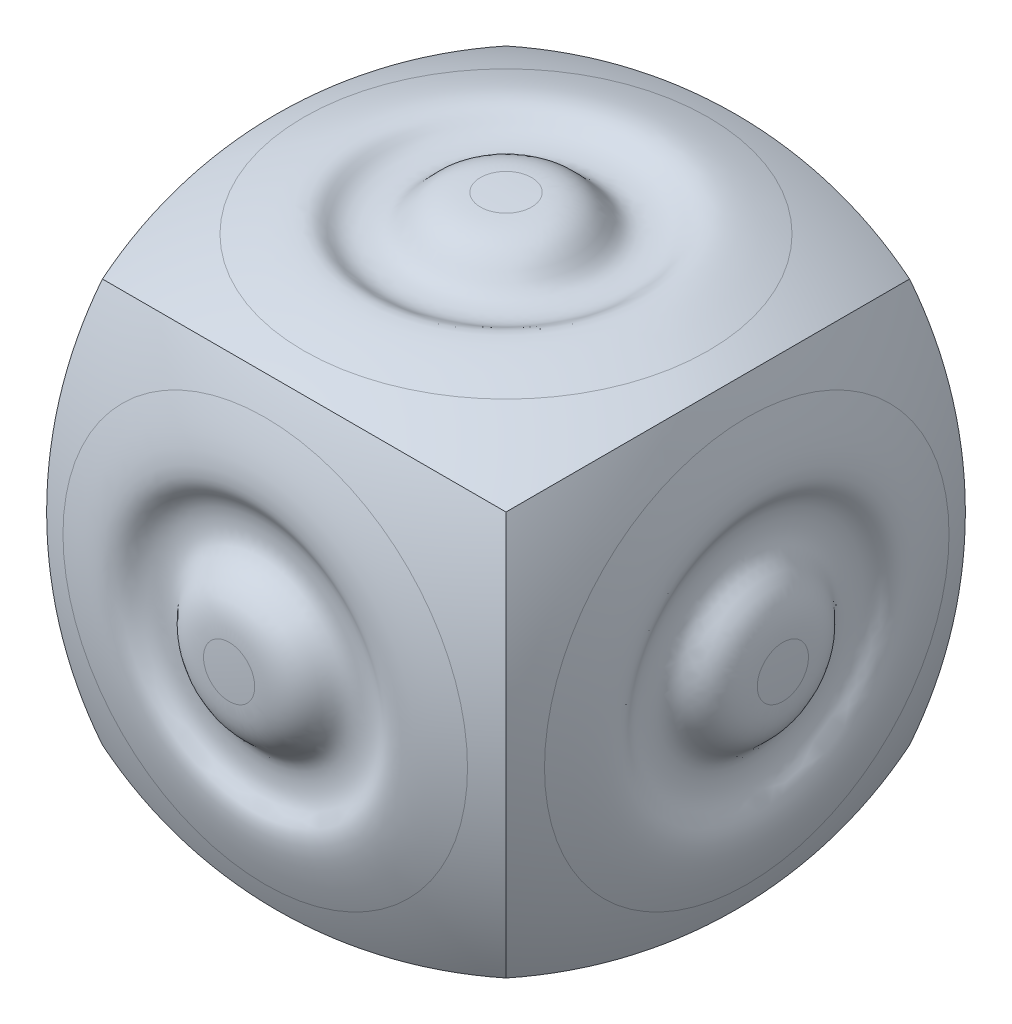
ISO-10303-21;
HEADER;
FILE_DESCRIPTION(('STEP AP214'),'2;1');
FILE_NAME('part.step','',(''),(''),'','','');
FILE_SCHEMA(('AUTOMOTIVE_DESIGN { 1 0 10303 214 1 1 1 1 }'));
ENDSEC;
DATA;
#1=APPLICATION_CONTEXT('core data for automotive mechanical design processes');
#2=APPLICATION_PROTOCOL_DEFINITION('international standard','automotive_design',2000,#1);
#3=PRODUCT_CONTEXT('',#1,'mechanical');
#4=PRODUCT('Part','Part','',(#3));
#5=PRODUCT_RELATED_PRODUCT_CATEGORY('part','',(#4));
#6=PRODUCT_DEFINITION_FORMATION('','',#4);
#7=PRODUCT_DEFINITION_CONTEXT('part definition',#1,'design');
#8=PRODUCT_DEFINITION('design','',#6,#7);
#9=PRODUCT_DEFINITION_SHAPE('','',#8);
#10=(LENGTH_UNIT() NAMED_UNIT(*) SI_UNIT(.MILLI.,.METRE.));
#11=(NAMED_UNIT(*) PLANE_ANGLE_UNIT() SI_UNIT($,.RADIAN.));
#12=(NAMED_UNIT(*) SI_UNIT($,.STERADIAN.) SOLID_ANGLE_UNIT());
#13=UNCERTAINTY_MEASURE_WITH_UNIT(LENGTH_MEASURE(1.E-05),#10,'distance_accuracy_value','');
#14=(GEOMETRIC_REPRESENTATION_CONTEXT(3) GLOBAL_UNCERTAINTY_ASSIGNED_CONTEXT((#13)) GLOBAL_UNIT_ASSIGNED_CONTEXT((#10,
#11,#12)) REPRESENTATION_CONTEXT('',''));
#15=CARTESIAN_POINT('',(0.,0.,0.));
#16=DIRECTION('',(0.,0.,1.));
#17=DIRECTION('',(1.,0.,0.));
#18=AXIS2_PLACEMENT_3D('',#15,#16,#17);
#19=CARTESIAN_POINT('',(18.7854166666667,-1.96766909169521E-13,0.));
#20=DIRECTION('',(-1.,0.,0.));
#21=DIRECTION('',(0.,-0.707106781186547,0.707106781186548));
#22=AXIS2_PLACEMENT_3D('',#19,#20,#21);
#23=SPHERICAL_SURFACE('',#22,36.2479166666667);
#24=CARTESIAN_POINT('',(-15.1534115753133,1.58723653137746E-13,0.));
#25=DIRECTION('',(-1.,0.,0.));
#26=DIRECTION('',(0.,0.,1.));
#27=AXIS2_PLACEMENT_3D('',#24,#25,#26);
#28=CIRCLE('',#27,12.7305695173074);
#29=CARTESIAN_POINT('',(-15.1534115753133,1.58723653137746E-13,12.7305695173074));
#30=VERTEX_POINT('',#29);
#31=EDGE_CURVE('E132',#30,#30,#28,.T.);
#32=ORIENTED_EDGE('',*,*,#31,.F.);
#33=EDGE_LOOP('',(#32));
#34=FACE_BOUND('',#33,.T.);
#35=CARTESIAN_POINT('',(9.39270833333339,0.,9.39270833333335));
#36=DIRECTION('',(0.707106781186546,0.,-0.707106781186549));
#37=DIRECTION('',(-0.707106781186549,0.,-0.707106781186546));
#38=AXIS2_PLACEMENT_3D('',#35,#36,#37);
#39=CIRCLE('',#38,33.7263327832048);
#40=CARTESIAN_POINT('',(-12.7000000000002,-12.6999999999999,-12.6999999999999));
#41=VERTEX_POINT('',#40);
#42=CARTESIAN_POINT('',(-12.7,12.7,-12.7));
#43=VERTEX_POINT('',#42);
#44=EDGE_CURVE('E88',#41,#43,#39,.T.);
#45=ORIENTED_EDGE('',*,*,#44,.F.);
#46=CARTESIAN_POINT('',(9.39270833333342,9.39270833333325,0.));
#47=DIRECTION('',(0.707106781186541,-0.707106781186554,0.));
#48=DIRECTION('',(0.707106781186554,0.707106781186541,0.));
#49=AXIS2_PLACEMENT_3D('',#46,#47,#48);
#50=CIRCLE('',#49,33.7263327832048);
#51=CARTESIAN_POINT('',(-12.7000000000001,-12.6999999999998,12.7000000000001));
#52=VERTEX_POINT('',#51);
#53=EDGE_CURVE('E74',#52,#41,#50,.T.);
#54=ORIENTED_EDGE('',*,*,#53,.F.);
#55=CARTESIAN_POINT('',(9.39270833333326,0.,-9.39270833333335));
#56=DIRECTION('',(0.707106781186551,0.,0.707106781186544));
#57=DIRECTION('',(0.707106781186544,0.,-0.707106781186551));
#58=AXIS2_PLACEMENT_3D('',#55,#56,#57);
#59=CIRCLE('',#58,33.7263327832047);
#60=CARTESIAN_POINT('',(-12.6999999999998,12.7,12.7000000000002));
#61=VERTEX_POINT('',#60);
#62=EDGE_CURVE('E77',#61,#52,#59,.T.);
#63=ORIENTED_EDGE('',*,*,#62,.F.);
#64=CARTESIAN_POINT('',(9.39270833333335,-9.39270833333345,0.));
#65=DIRECTION('',(0.707106781186551,0.707106781186544,0.));
#66=DIRECTION('',(-0.707106781186544,0.707106781186551,0.));
#67=AXIS2_PLACEMENT_3D('',#64,#65,#66);
#68=CIRCLE('',#67,33.7263327832048);
#69=EDGE_CURVE('E190',#43,#61,#68,.T.);
#70=ORIENTED_EDGE('',*,*,#69,.F.);
#71=EDGE_LOOP('',(#45,#54,#63,#70));
#72=FACE_BOUND('',#71,.T.);
#73=ADVANCED_FACE('F36',(#34,#72),#23,.T.);
#74=CARTESIAN_POINT('',(-17.4266823510349,-1.13915481954516,1.13915481954534));
#75=CARTESIAN_POINT('',(-17.4200180132939,-1.24507969210153,1.24507969210171));
#76=CARTESIAN_POINT('',(-17.2836185289348,-3.14658954471395,3.14658954471413));
#77=CARTESIAN_POINT('',(-15.2471014807976,-3.10324904137452,3.10324904137468));
#78=CARTESIAN_POINT('',(-15.1976657736557,-6.19728647304556,6.19728647304572));
#79=CARTESIAN_POINT('',(-16.976207066379,-5.44673132230468,5.44673132230486));
#80=CARTESIAN_POINT('',(-15.25234045371,-8.81538136859229,8.81538136859246));
#81=CARTESIAN_POINT('',(-15.1534115753134,-9.00187203405464,9.0018720340548));
#82=B_SPLINE_CURVE_WITH_KNOTS('',3,(#74,#75,#76,#77,#78,#79,#80,#81),.UNSPECIFIED.,.F.,.F.,(4,1,
1,1,1,4),(0.,0.0204895370411278,0.368811666740301,0.468811666740301,0.970489537041128,1.),.UNSPECIFIED.);
#83=CARTESIAN_POINT('',(0.,0.,0.));
#84=DIRECTION('',(-1.,0.,0.));
#85=AXIS1_PLACEMENT('',#83,#84);
#86=SURFACE_OF_REVOLUTION('',#82,#85);
#87=ORIENTED_EDGE('',*,*,#31,.T.);
#88=EDGE_LOOP('',(#87));
#89=FACE_BOUND('',#88,.T.);
#90=CARTESIAN_POINT('',(-17.4266823510349,1.82534914403931E-13,0.));
#91=DIRECTION('',(-1.,0.,0.));
#92=DIRECTION('',(0.,0.,1.));
#93=AXIS2_PLACEMENT_3D('',#90,#91,#92);
#94=CIRCLE('',#93,1.61100819544372);
#95=CARTESIAN_POINT('',(-17.4266823510349,1.82534914403931E-13,1.61100819544372));
#96=VERTEX_POINT('',#95);
#97=EDGE_CURVE('E40',#96,#96,#94,.T.);
#98=ORIENTED_EDGE('',*,*,#97,.F.);
#99=EDGE_LOOP('',(#98));
#100=FACE_BOUND('',#99,.T.);
#101=ADVANCED_FACE('F123',(#89,#100),#86,.F.);
#102=CARTESIAN_POINT('',(18.7854166666667,-1.96766909169521E-13,0.));
#103=DIRECTION('',(-1.,0.,0.));
#104=DIRECTION('',(0.,0.707106781186547,-0.707106781186548));
#105=AXIS2_PLACEMENT_3D('',#102,#103,#104);
#106=SPHERICAL_SURFACE('',#105,36.2479166666667);
#107=ORIENTED_EDGE('',*,*,#97,.T.);
#108=EDGE_LOOP('',(#107));
#109=FACE_BOUND('',#108,.T.);
#110=ADVANCED_FACE('F38',(#109),#106,.T.);
#111=CARTESIAN_POINT('',(-1.96766909169521E-13,0.,-18.7854166666667));
#112=DIRECTION('',(0.,0.,1.));
#113=DIRECTION('',(-0.707106781186548,0.707106781186547,0.));
#114=AXIS2_PLACEMENT_3D('',#111,#112,#113);
#115=SPHERICAL_SURFACE('',#114,36.2479166666667);
#116=CARTESIAN_POINT('',(1.58723653137746E-13,0.,15.1534115753133));
#117=DIRECTION('',(0.,0.,1.));
#118=DIRECTION('',(-1.,0.,0.));
#119=AXIS2_PLACEMENT_3D('',#116,#117,#118);
#120=CIRCLE('',#119,12.7305695173074);
#121=CARTESIAN_POINT('',(-12.7305695173072,0.,15.1534115753134));
#122=VERTEX_POINT('',#121);
#123=EDGE_CURVE('E86',#122,#122,#120,.T.);
#124=ORIENTED_EDGE('',*,*,#123,.F.);
#125=EDGE_LOOP('',(#124));
#126=FACE_BOUND('',#125,.T.);
#127=ORIENTED_EDGE('',*,*,#62,.T.);
#128=CARTESIAN_POINT('',(0.,9.39270833333339,-9.39270833333335));
#129=DIRECTION('',(0.,-0.707106781186546,-0.707106781186549));
#130=DIRECTION('',(0.,0.707106781186549,-0.707106781186546));
#131=AXIS2_PLACEMENT_3D('',#128,#129,#130);
#132=CIRCLE('',#131,33.7263327832048);
#133=CARTESIAN_POINT('',(12.7,-12.7000000000002,12.6999999999999));
#134=VERTEX_POINT('',#133);
#135=EDGE_CURVE('E79',#134,#52,#132,.T.);
#136=ORIENTED_EDGE('',*,*,#135,.F.);
#137=CARTESIAN_POINT('',(-9.39270833333345,0.,-9.39270833333335));
#138=DIRECTION('',(0.707106781186544,0.,-0.707106781186551));
#139=DIRECTION('',(-0.707106781186551,0.,-0.707106781186544));
#140=AXIS2_PLACEMENT_3D('',#137,#138,#139);
#141=CIRCLE('',#140,33.7263327832048);
#142=CARTESIAN_POINT('',(12.7,12.7,12.6999999999999));
#143=VERTEX_POINT('',#142);
#144=EDGE_CURVE('E55',#143,#134,#141,.T.);
#145=ORIENTED_EDGE('',*,*,#144,.F.);
#146=CARTESIAN_POINT('',(0.,-9.39270833333332,-9.39270833333335));
#147=DIRECTION('',(0.,0.707106781186549,-0.707106781186546));
#148=DIRECTION('',(0.,0.707106781186546,0.707106781186549));
#149=AXIS2_PLACEMENT_3D('',#146,#147,#148);
#150=CIRCLE('',#149,33.7263327832048);
#151=EDGE_CURVE('E81',#61,#143,#150,.T.);
#152=ORIENTED_EDGE('',*,*,#151,.F.);
#153=EDGE_LOOP('',(#127,#136,#145,#152));
#154=FACE_BOUND('',#153,.T.);
#155=ADVANCED_FACE('F78',(#126,#154),#115,.T.);
#156=CARTESIAN_POINT('',(-1.13915481954516,1.13915481954528,17.4266823510349));
#157=CARTESIAN_POINT('',(-1.24507969210153,1.24507969210165,17.4200180132939));
#158=CARTESIAN_POINT('',(-3.14658954471395,3.14658954471407,17.2836185289348));
#159=CARTESIAN_POINT('',(-3.10324904137452,3.10324904137463,15.2471014807976));
#160=CARTESIAN_POINT('',(-6.19728647304556,6.19728647304566,15.1976657736557));
#161=CARTESIAN_POINT('',(-5.44673132230468,5.4467313223048,16.976207066379));
#162=CARTESIAN_POINT('',(-8.8153813685923,8.8153813685924,15.2523404537101));
#163=CARTESIAN_POINT('',(-9.00187203405464,9.00187203405474,15.1534115753134));
#164=B_SPLINE_CURVE_WITH_KNOTS('',3,(#156,#157,#158,#159,#160,#161,#162,#163),.UNSPECIFIED.,.F.,
.F.,(4,1,1,1,1,4),(0.,0.0204895370411278,0.368811666740301,0.468811666740301,0.970489537041128,
1.),.UNSPECIFIED.);
#165=CARTESIAN_POINT('',(0.,0.,0.));
#166=DIRECTION('',(0.,0.,1.));
#167=AXIS1_PLACEMENT('',#165,#166);
#168=SURFACE_OF_REVOLUTION('',#164,#167);
#169=ORIENTED_EDGE('',*,*,#123,.T.);
#170=EDGE_LOOP('',(#169));
#171=FACE_BOUND('',#170,.T.);
#172=CARTESIAN_POINT('',(1.82534914403931E-13,0.,17.4266823510349));
#173=DIRECTION('',(0.,0.,1.));
#174=DIRECTION('',(-1.,0.,0.));
#175=AXIS2_PLACEMENT_3D('',#172,#173,#174);
#176=CIRCLE('',#175,1.61100819544372);
#177=CARTESIAN_POINT('',(-1.61100819544354,0.,17.4266823510349));
#178=VERTEX_POINT('',#177);
#179=EDGE_CURVE('E85',#178,#178,#176,.T.);
#180=ORIENTED_EDGE('',*,*,#179,.F.);
#181=EDGE_LOOP('',(#180));
#182=FACE_BOUND('',#181,.T.);
#183=ADVANCED_FACE('F112',(#171,#182),#168,.F.);
#184=CARTESIAN_POINT('',(-1.96766909169521E-13,0.,-18.7854166666667));
#185=DIRECTION('',(0.,0.,1.));
#186=DIRECTION('',(0.707106781186548,-0.707106781186547,0.));
#187=AXIS2_PLACEMENT_3D('',#184,#185,#186);
#188=SPHERICAL_SURFACE('',#187,36.2479166666667);
#189=ORIENTED_EDGE('',*,*,#179,.T.);
#190=EDGE_LOOP('',(#189));
#191=FACE_BOUND('',#190,.T.);
#192=ADVANCED_FACE('F116',(#191),#188,.T.);
#193=CARTESIAN_POINT('',(1.31177939446347E-13,18.7854166666667,0.));
#194=DIRECTION('',(0.,-1.,0.));
#195=DIRECTION('',(0.707106781186547,0.,0.707106781186548));
#196=AXIS2_PLACEMENT_3D('',#193,#194,#195);
#197=SPHERICAL_SURFACE('',#196,36.2479166666667);
#198=CARTESIAN_POINT('',(-1.05815768758497E-13,-15.1534115753133,0.));
#199=DIRECTION('',(0.,-1.,0.));
#200=DIRECTION('',(0.,0.,1.));
#201=AXIS2_PLACEMENT_3D('',#198,#199,#200);
#202=CIRCLE('',#201,12.7305695173074);
#203=CARTESIAN_POINT('',(-1.05815768758497E-13,-15.1534115753133,12.7305695173074));
#204=VERTEX_POINT('',#203);
#205=EDGE_CURVE('E95',#204,#204,#202,.T.);
#206=ORIENTED_EDGE('',*,*,#205,.F.);
#207=EDGE_LOOP('',(#206));
#208=FACE_BOUND('',#207,.T.);
#209=ORIENTED_EDGE('',*,*,#135,.T.);
#210=ORIENTED_EDGE('',*,*,#53,.T.);
#211=CARTESIAN_POINT('',(0.,9.39270833333339,9.39270833333335));
#212=DIRECTION('',(0.,0.707106781186546,-0.707106781186549));
#213=DIRECTION('',(0.,0.707106781186549,0.707106781186546));
#214=AXIS2_PLACEMENT_3D('',#211,#212,#213);
#215=CIRCLE('',#214,33.7263327832048);
#216=CARTESIAN_POINT('',(12.6999999999999,-12.7000000000001,-12.7));
#217=VERTEX_POINT('',#216);
#218=EDGE_CURVE('E230',#217,#41,#215,.T.);
#219=ORIENTED_EDGE('',*,*,#218,.F.);
#220=CARTESIAN_POINT('',(-9.39270833333329,9.39270833333339,0.));
#221=DIRECTION('',(0.707106781186551,0.707106781186544,0.));
#222=DIRECTION('',(-0.707106781186544,0.707106781186551,0.));
#223=AXIS2_PLACEMENT_3D('',#220,#221,#222);
#224=CIRCLE('',#223,33.7263327832048);
#225=EDGE_CURVE('E94',#134,#217,#224,.T.);
#226=ORIENTED_EDGE('',*,*,#225,.F.);
#227=EDGE_LOOP('',(#209,#210,#219,#226));
#228=FACE_BOUND('',#227,.T.);
#229=ADVANCED_FACE('F92',(#208,#228),#197,.T.);
#230=CARTESIAN_POINT('',(1.13915481954522,-17.4266823510349,1.13915481954534));
#231=CARTESIAN_POINT('',(1.24507969210159,-17.4200180132939,1.24507969210171));
#232=CARTESIAN_POINT('',(3.14658954471401,-17.2836185289348,3.14658954471413));
#233=CARTESIAN_POINT('',(3.10324904137457,-15.2471014807976,3.10324904137468));
#234=CARTESIAN_POINT('',(6.19728647304561,-15.1976657736557,6.19728647304572));
#235=CARTESIAN_POINT('',(5.44673132230474,-16.976207066379,5.44673132230486));
#236=CARTESIAN_POINT('',(8.81538136859235,-15.25234045371,8.81538136859246));
#237=CARTESIAN_POINT('',(9.00187203405469,-15.1534115753134,9.0018720340548));
#238=B_SPLINE_CURVE_WITH_KNOTS('',3,(#230,#231,#232,#233,#234,#235,#236,#237),.UNSPECIFIED.,.F.,
.F.,(4,1,1,1,1,4),(0.,0.0204895370411278,0.368811666740301,0.468811666740301,0.970489537041128,
1.),.UNSPECIFIED.);
#239=CARTESIAN_POINT('',(0.,0.,0.));
#240=DIRECTION('',(0.,-1.,0.));
#241=AXIS1_PLACEMENT('',#239,#240);
#242=SURFACE_OF_REVOLUTION('',#238,#241);
#243=ORIENTED_EDGE('',*,*,#205,.T.);
#244=EDGE_LOOP('',(#243));
#245=FACE_BOUND('',#244,.T.);
#246=CARTESIAN_POINT('',(-1.21689942935954E-13,-17.4266823510349,0.));
#247=DIRECTION('',(0.,-1.,0.));
#248=DIRECTION('',(0.,0.,1.));
#249=AXIS2_PLACEMENT_3D('',#246,#247,#248);
#250=CIRCLE('',#249,1.61100819544372);
#251=CARTESIAN_POINT('',(-1.21689942935954E-13,-17.4266823510349,1.61100819544372));
#252=VERTEX_POINT('',#251);
#253=EDGE_CURVE('E90',#252,#252,#250,.T.);
#254=ORIENTED_EDGE('',*,*,#253,.F.);
#255=EDGE_LOOP('',(#254));
#256=FACE_BOUND('',#255,.T.);
#257=ADVANCED_FACE('F216',(#245,#256),#242,.F.);
#258=CARTESIAN_POINT('',(1.31177939446347E-13,18.7854166666667,0.));
#259=DIRECTION('',(0.,-1.,0.));
#260=DIRECTION('',(-0.707106781186547,0.,-0.707106781186548));
#261=AXIS2_PLACEMENT_3D('',#258,#259,#260);
#262=SPHERICAL_SURFACE('',#261,36.2479166666667);
#263=ORIENTED_EDGE('',*,*,#253,.T.);
#264=EDGE_LOOP('',(#263));
#265=FACE_BOUND('',#264,.T.);
#266=ADVANCED_FACE('F219',(#265),#262,.T.);
#267=CARTESIAN_POINT('',(0.,0.,18.7854166666667));
#268=DIRECTION('',(0.,0.,-1.));
#269=DIRECTION('',(0.707106781186548,0.707106781186547,0.));
#270=AXIS2_PLACEMENT_3D('',#267,#268,#269);
#271=SPHERICAL_SURFACE('',#270,36.2479166666667);
#272=CARTESIAN_POINT('',(0.,0.,-15.1534115753133));
#273=DIRECTION('',(0.,0.,-1.));
#274=DIRECTION('',(1.,0.,0.));
#275=AXIS2_PLACEMENT_3D('',#272,#273,#274);
#276=CIRCLE('',#275,12.7305695173074);
#277=CARTESIAN_POINT('',(12.7305695173073,0.,-15.1534115753133));
#278=VERTEX_POINT('',#277);
#279=EDGE_CURVE('E103',#278,#278,#276,.T.);
#280=ORIENTED_EDGE('',*,*,#279,.F.);
#281=EDGE_LOOP('',(#280));
#282=FACE_BOUND('',#281,.T.);
#283=CARTESIAN_POINT('',(-9.39270833333332,0.,9.39270833333335));
#284=DIRECTION('',(0.707106781186549,0.,0.707106781186546));
#285=DIRECTION('',(0.707106781186546,0.,-0.707106781186549));
#286=AXIS2_PLACEMENT_3D('',#283,#284,#285);
#287=CIRCLE('',#286,33.7263327832048);
#288=CARTESIAN_POINT('',(12.7,12.6999999999999,-12.7));
#289=VERTEX_POINT('',#288);
#290=EDGE_CURVE('E239',#217,#289,#287,.T.);
#291=ORIENTED_EDGE('',*,*,#290,.F.);
#292=ORIENTED_EDGE('',*,*,#218,.T.);
#293=ORIENTED_EDGE('',*,*,#44,.T.);
#294=CARTESIAN_POINT('',(0.,-9.39270833333332,9.39270833333335));
#295=DIRECTION('',(0.,0.707106781186549,0.707106781186546));
#296=DIRECTION('',(0.,-0.707106781186546,0.707106781186549));
#297=AXIS2_PLACEMENT_3D('',#294,#295,#296);
#298=CIRCLE('',#297,33.7263327832048);
#299=EDGE_CURVE('E186',#289,#43,#298,.T.);
#300=ORIENTED_EDGE('',*,*,#299,.F.);
#301=EDGE_LOOP('',(#291,#292,#293,#300));
#302=FACE_BOUND('',#301,.T.);
#303=ADVANCED_FACE('F209',(#282,#302),#271,.T.);
#304=CARTESIAN_POINT('',(1.13915481954528,1.13915481954528,-17.4266823510349));
#305=CARTESIAN_POINT('',(1.24507969210165,1.24507969210165,-17.4200180132939));
#306=CARTESIAN_POINT('',(3.14658954471407,3.14658954471407,-17.2836185289348));
#307=CARTESIAN_POINT('',(3.10324904137463,3.10324904137463,-15.2471014807976));
#308=CARTESIAN_POINT('',(6.19728647304566,6.19728647304566,-15.1976657736557));
#309=CARTESIAN_POINT('',(5.4467313223048,5.4467313223048,-16.976207066379));
#310=CARTESIAN_POINT('',(8.8153813685924,8.8153813685924,-15.25234045371));
#311=CARTESIAN_POINT('',(9.00187203405475,9.00187203405474,-15.1534115753134));
#312=B_SPLINE_CURVE_WITH_KNOTS('',3,(#304,#305,#306,#307,#308,#309,#310,#311),.UNSPECIFIED.,.F.,
.F.,(4,1,1,1,1,4),(0.,0.0204895370411278,0.368811666740301,0.468811666740301,0.970489537041128,
1.),.UNSPECIFIED.);
#313=CARTESIAN_POINT('',(0.,0.,0.));
#314=DIRECTION('',(0.,0.,-1.));
#315=AXIS1_PLACEMENT('',#313,#314);
#316=SURFACE_OF_REVOLUTION('',#312,#315);
#317=ORIENTED_EDGE('',*,*,#279,.T.);
#318=EDGE_LOOP('',(#317));
#319=FACE_BOUND('',#318,.T.);
#320=CARTESIAN_POINT('',(0.,0.,-17.4266823510349));
#321=DIRECTION('',(0.,0.,-1.));
#322=DIRECTION('',(1.,0.,0.));
#323=AXIS2_PLACEMENT_3D('',#320,#321,#322);
#324=CIRCLE('',#323,1.61100819544372);
#325=CARTESIAN_POINT('',(1.61100819544366,0.,-17.4266823510349));
#326=VERTEX_POINT('',#325);
#327=EDGE_CURVE('E187',#326,#326,#324,.T.);
#328=ORIENTED_EDGE('',*,*,#327,.F.);
#329=EDGE_LOOP('',(#328));
#330=FACE_BOUND('',#329,.T.);
#331=ADVANCED_FACE('F206',(#319,#330),#316,.F.);
#332=CARTESIAN_POINT('',(0.,0.,18.7854166666667));
#333=DIRECTION('',(0.,0.,-1.));
#334=DIRECTION('',(-0.707106781186548,-0.707106781186547,0.));
#335=AXIS2_PLACEMENT_3D('',#332,#333,#334);
#336=SPHERICAL_SURFACE('',#335,36.2479166666667);
#337=ORIENTED_EDGE('',*,*,#327,.T.);
#338=EDGE_LOOP('',(#337));
#339=FACE_BOUND('',#338,.T.);
#340=ADVANCED_FACE('F167',(#339),#336,.T.);
#341=CARTESIAN_POINT('',(0.,-18.7854166666667,0.));
#342=DIRECTION('',(0.,1.,0.));
#343=DIRECTION('',(-0.707106781186547,0.,0.707106781186548));
#344=AXIS2_PLACEMENT_3D('',#341,#342,#343);
#345=SPHERICAL_SURFACE('',#344,36.2479166666667);
#346=CARTESIAN_POINT('',(0.,15.1534115753133,0.));
#347=DIRECTION('',(0.,1.,0.));
#348=DIRECTION('',(0.,0.,1.));
#349=AXIS2_PLACEMENT_3D('',#346,#347,#348);
#350=CIRCLE('',#349,12.7305695173074);
#351=CARTESIAN_POINT('',(0.,15.1534115753133,12.7305695173074));
#352=VERTEX_POINT('',#351);
#353=EDGE_CURVE('E180',#352,#352,#350,.T.);
#354=ORIENTED_EDGE('',*,*,#353,.F.);
#355=EDGE_LOOP('',(#354));
#356=FACE_BOUND('',#355,.T.);
#357=ORIENTED_EDGE('',*,*,#299,.T.);
#358=ORIENTED_EDGE('',*,*,#69,.T.);
#359=ORIENTED_EDGE('',*,*,#151,.T.);
#360=CARTESIAN_POINT('',(-9.39270833333335,-9.39270833333332,0.));
#361=DIRECTION('',(0.707106781186546,-0.707106781186549,0.));
#362=DIRECTION('',(0.707106781186549,0.707106781186546,0.));
#363=AXIS2_PLACEMENT_3D('',#360,#361,#362);
#364=CIRCLE('',#363,33.7263327832048);
#365=EDGE_CURVE('E46',#289,#143,#364,.T.);
#366=ORIENTED_EDGE('',*,*,#365,.F.);
#367=EDGE_LOOP('',(#357,#358,#359,#366));
#368=FACE_BOUND('',#367,.T.);
#369=ADVANCED_FACE('F163',(#356,#368),#345,.T.);
#370=CARTESIAN_POINT('',(-1.13915481954534,17.4266823510349,1.13915481954534));
#371=CARTESIAN_POINT('',(-1.24507969210171,17.4200180132939,1.24507969210171));
#372=CARTESIAN_POINT('',(-3.14658954471413,17.2836185289348,3.14658954471413));
#373=CARTESIAN_POINT('',(-3.10324904137468,15.2471014807976,3.10324904137468));
#374=CARTESIAN_POINT('',(-6.19728647304572,15.1976657736556,6.19728647304572));
#375=CARTESIAN_POINT('',(-5.44673132230486,16.976207066379,5.44673132230486));
#376=CARTESIAN_POINT('',(-8.81538136859245,15.2523404537099,8.81538136859246));
#377=CARTESIAN_POINT('',(-9.0018720340548,15.1534115753133,9.0018720340548));
#378=B_SPLINE_CURVE_WITH_KNOTS('',3,(#370,#371,#372,#373,#374,#375,#376,#377),.UNSPECIFIED.,.F.,
.F.,(4,1,1,1,1,4),(0.,0.0204895370411278,0.368811666740301,0.468811666740301,0.970489537041128,
1.),.UNSPECIFIED.);
#379=CARTESIAN_POINT('',(0.,0.,0.));
#380=DIRECTION('',(0.,1.,0.));
#381=AXIS1_PLACEMENT('',#379,#380);
#382=SURFACE_OF_REVOLUTION('',#378,#381);
#383=ORIENTED_EDGE('',*,*,#353,.T.);
#384=EDGE_LOOP('',(#383));
#385=FACE_BOUND('',#384,.T.);
#386=CARTESIAN_POINT('',(0.,17.4266823510349,0.));
#387=DIRECTION('',(0.,1.,0.));
#388=DIRECTION('',(0.,0.,1.));
#389=AXIS2_PLACEMENT_3D('',#386,#387,#388);
#390=CIRCLE('',#389,1.61100819544372);
#391=CARTESIAN_POINT('',(0.,17.4266823510349,1.61100819544372));
#392=VERTEX_POINT('',#391);
#393=EDGE_CURVE('E193',#392,#392,#390,.T.);
#394=ORIENTED_EDGE('',*,*,#393,.F.);
#395=EDGE_LOOP('',(#394));
#396=FACE_BOUND('',#395,.T.);
#397=ADVANCED_FACE('F166',(#385,#396),#382,.F.);
#398=CARTESIAN_POINT('',(0.,-18.7854166666667,0.));
#399=DIRECTION('',(0.,1.,0.));
#400=DIRECTION('',(0.707106781186547,0.,-0.707106781186548));
#401=AXIS2_PLACEMENT_3D('',#398,#399,#400);
#402=SPHERICAL_SURFACE('',#401,36.2479166666667);
#403=ORIENTED_EDGE('',*,*,#393,.T.);
#404=EDGE_LOOP('',(#403));
#405=FACE_BOUND('',#404,.T.);
#406=ADVANCED_FACE('F172',(#405),#402,.T.);
#407=CARTESIAN_POINT('',(-18.7854166666667,0.,0.));
#408=DIRECTION('',(1.,0.,0.));
#409=DIRECTION('',(0.,0.707106781186547,0.707106781186548));
#410=AXIS2_PLACEMENT_3D('',#407,#408,#409);
#411=SPHERICAL_SURFACE('',#410,36.2479166666667);
#412=CARTESIAN_POINT('',(15.1534115753133,0.,0.));
#413=DIRECTION('',(1.,0.,0.));
#414=DIRECTION('',(0.,0.,1.));
#415=AXIS2_PLACEMENT_3D('',#412,#413,#414);
#416=CIRCLE('',#415,12.7305695173074);
#417=CARTESIAN_POINT('',(15.1534115753133,0.,12.7305695173074));
#418=VERTEX_POINT('',#417);
#419=EDGE_CURVE('E196',#418,#418,#416,.T.);
#420=ORIENTED_EDGE('',*,*,#419,.F.);
#421=EDGE_LOOP('',(#420));
#422=FACE_BOUND('',#421,.T.);
#423=ORIENTED_EDGE('',*,*,#144,.T.);
#424=ORIENTED_EDGE('',*,*,#225,.T.);
#425=ORIENTED_EDGE('',*,*,#290,.T.);
#426=ORIENTED_EDGE('',*,*,#365,.T.);
#427=EDGE_LOOP('',(#423,#424,#425,#426));
#428=FACE_BOUND('',#427,.T.);
#429=ADVANCED_FACE('F157',(#422,#428),#411,.T.);
#430=CARTESIAN_POINT('',(17.4266823510349,1.13915481954528,1.13915481954534));
#431=CARTESIAN_POINT('',(17.4200180132939,1.24507969210165,1.24507969210171));
#432=CARTESIAN_POINT('',(17.2836185289348,3.14658954471407,3.14658954471413));
#433=CARTESIAN_POINT('',(15.2471014807976,3.10324904137463,3.10324904137468));
#434=CARTESIAN_POINT('',(15.1976657736556,6.19728647304566,6.19728647304572));
#435=CARTESIAN_POINT('',(16.976207066379,5.4467313223048,5.44673132230486));
#436=CARTESIAN_POINT('',(15.25234045371,8.8153813685924,8.81538136859246));
#437=CARTESIAN_POINT('',(15.1534115753133,9.00187203405474,9.0018720340548));
#438=B_SPLINE_CURVE_WITH_KNOTS('',3,(#430,#431,#432,#433,#434,#435,#436,#437),.UNSPECIFIED.,.F.,
.F.,(4,1,1,1,1,4),(0.,0.0204895370411278,0.368811666740301,0.468811666740301,0.970489537041128,
1.),.UNSPECIFIED.);
#439=CARTESIAN_POINT('',(0.,0.,0.));
#440=DIRECTION('',(1.,0.,0.));
#441=AXIS1_PLACEMENT('',#439,#440);
#442=SURFACE_OF_REVOLUTION('',#438,#441);
#443=ORIENTED_EDGE('',*,*,#419,.T.);
#444=EDGE_LOOP('',(#443));
#445=FACE_BOUND('',#444,.T.);
#446=CARTESIAN_POINT('',(17.4266823510349,0.,0.));
#447=DIRECTION('',(1.,0.,0.));
#448=DIRECTION('',(0.,0.,1.));
#449=AXIS2_PLACEMENT_3D('',#446,#447,#448);
#450=CIRCLE('',#449,1.61100819544372);
#451=CARTESIAN_POINT('',(17.4266823510349,0.,1.61100819544372));
#452=VERTEX_POINT('',#451);
#453=EDGE_CURVE('E11',#452,#452,#450,.T.);
#454=ORIENTED_EDGE('',*,*,#453,.F.);
#455=EDGE_LOOP('',(#454));
#456=FACE_BOUND('',#455,.T.);
#457=ADVANCED_FACE('F151',(#445,#456),#442,.F.);
#458=CARTESIAN_POINT('',(-18.7854166666667,0.,0.));
#459=DIRECTION('',(1.,0.,0.));
#460=DIRECTION('',(0.,-0.707106781186547,-0.707106781186548));
#461=AXIS2_PLACEMENT_3D('',#458,#459,#460);
#462=SPHERICAL_SURFACE('',#461,36.2479166666667);
#463=ORIENTED_EDGE('',*,*,#453,.T.);
#464=EDGE_LOOP('',(#463));
#465=FACE_BOUND('',#464,.T.);
#466=ADVANCED_FACE('F149',(#465),#462,.T.);
#467=CLOSED_SHELL('',(#73,#101,#110,#155,#183,#192,#229,#257,#266,#303,#331,#340,#369,#397,#406,
#429,#457,#466));
#468=MANIFOLD_SOLID_BREP('B2',#467);
#469=ADVANCED_BREP_SHAPE_REPRESENTATION('',(#18,#468),#14);
#470=SHAPE_DEFINITION_REPRESENTATION(#9,#469);
ENDSEC;
END-ISO-10303-21;
